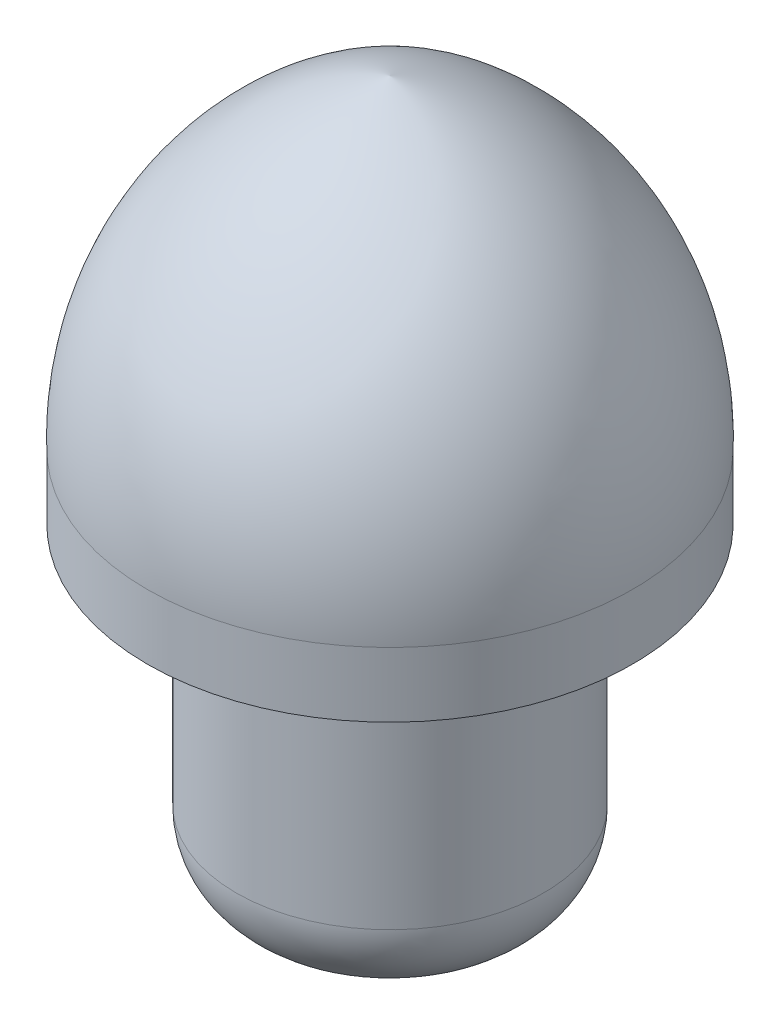
ISO-10303-21;
HEADER;
FILE_DESCRIPTION(('STEP AP214'),'2;1');
FILE_NAME('part.step','',(''),(''),'','','');
FILE_SCHEMA(('AUTOMOTIVE_DESIGN { 1 0 10303 214 1 1 1 1 }'));
ENDSEC;
DATA;
#1=APPLICATION_CONTEXT('core data for automotive mechanical design processes');
#2=APPLICATION_PROTOCOL_DEFINITION('international standard','automotive_design',2000,#1);
#3=PRODUCT_CONTEXT('',#1,'mechanical');
#4=PRODUCT('Part','Part','',(#3));
#5=PRODUCT_RELATED_PRODUCT_CATEGORY('part','',(#4));
#6=PRODUCT_DEFINITION_FORMATION('','',#4);
#7=PRODUCT_DEFINITION_CONTEXT('part definition',#1,'design');
#8=PRODUCT_DEFINITION('design','',#6,#7);
#9=PRODUCT_DEFINITION_SHAPE('','',#8);
#10=(LENGTH_UNIT() NAMED_UNIT(*) SI_UNIT(.MILLI.,.METRE.));
#11=(NAMED_UNIT(*) PLANE_ANGLE_UNIT() SI_UNIT($,.RADIAN.));
#12=(NAMED_UNIT(*) SI_UNIT($,.STERADIAN.) SOLID_ANGLE_UNIT());
#13=UNCERTAINTY_MEASURE_WITH_UNIT(LENGTH_MEASURE(1.E-05),#10,'distance_accuracy_value','');
#14=(GEOMETRIC_REPRESENTATION_CONTEXT(3) GLOBAL_UNCERTAINTY_ASSIGNED_CONTEXT((#13)) GLOBAL_UNIT_ASSIGNED_CONTEXT((#10,
#11,#12)) REPRESENTATION_CONTEXT('',''));
#15=CARTESIAN_POINT('',(0.,0.,0.));
#16=DIRECTION('',(0.,0.,1.));
#17=DIRECTION('',(1.,0.,0.));
#18=AXIS2_PLACEMENT_3D('',#15,#16,#17);
#19=CARTESIAN_POINT('',(0.,1.,0.));
#20=DIRECTION('',(0.,-1.,0.));
#21=DIRECTION('',(0.,0.,-1.));
#22=AXIS2_PLACEMENT_3D('',#19,#20,#21);
#23=CYLINDRICAL_SURFACE('',#22,15.);
#24=CARTESIAN_POINT('',(0.,-4.,0.));
#25=DIRECTION('',(0.,1.,0.));
#26=DIRECTION('',(0.,0.,1.));
#27=AXIS2_PLACEMENT_3D('',#24,#25,#26);
#28=CIRCLE('',#27,15.);
#29=CARTESIAN_POINT('',(0.,-4.,15.));
#30=VERTEX_POINT('',#29);
#31=EDGE_CURVE('E109',#30,#30,#28,.T.);
#32=ORIENTED_EDGE('',*,*,#31,.T.);
#33=EDGE_LOOP('',(#32));
#34=FACE_BOUND('',#33,.T.);
#35=CARTESIAN_POINT('',(0.,0.,0.));
#36=DIRECTION('',(0.,-1.,0.));
#37=DIRECTION('',(0.,0.,-1.));
#38=AXIS2_PLACEMENT_3D('',#35,#36,#37);
#39=CIRCLE('',#38,15.);
#40=CARTESIAN_POINT('',(0.,0.,-15.));
#41=VERTEX_POINT('',#40);
#42=EDGE_CURVE('E105',#41,#41,#39,.T.);
#43=ORIENTED_EDGE('',*,*,#42,.T.);
#44=EDGE_LOOP('',(#43));
#45=FACE_BOUND('',#44,.T.);
#46=ADVANCED_FACE('F42',(#34,#45),#23,.T.);
#47=CARTESIAN_POINT('',(0.,-4.,0.));
#48=DIRECTION('',(0.,1.,0.));
#49=DIRECTION('',(0.,0.,1.));
#50=AXIS2_PLACEMENT_3D('',#47,#48,#49);
#51=PLANE('',#50);
#52=CARTESIAN_POINT('',(0.,-4.,0.));
#53=DIRECTION('',(0.,-1.,0.));
#54=DIRECTION('',(0.,0.,-1.));
#55=AXIS2_PLACEMENT_3D('',#52,#53,#54);
#56=CIRCLE('',#55,9.5);
#57=CARTESIAN_POINT('',(0.,-4.,-9.5));
#58=VERTEX_POINT('',#57);
#59=EDGE_CURVE('E96',#58,#58,#56,.T.);
#60=ORIENTED_EDGE('',*,*,#59,.F.);
#61=EDGE_LOOP('',(#60));
#62=FACE_BOUND('',#61,.T.);
#63=ORIENTED_EDGE('',*,*,#31,.F.);
#64=EDGE_LOOP('',(#63));
#65=FACE_BOUND('',#64,.T.);
#66=ADVANCED_FACE('F75',(#62,#65),#51,.F.);
#67=CARTESIAN_POINT('',(0.,0.632503002402401,4.98999599679681));
#68=DIRECTION('',(-1.,0.,0.));
#69=DIRECTION('',(0.,0.,-1.));
#70=AXIS2_PLACEMENT_3D('',#67,#68,#69);
#71=CIRCLE('',#70,20.);
#72=TRIMMED_CURVE('',#71,(PARAMETER_VALUE(-1.31863264173032)),
(PARAMETER_VALUE(1.31863264173032)),.T.,.PARAMETER.);
#73=CARTESIAN_POINT('',(0.,0.632503002402401,0.));
#74=DIRECTION('',(0.,-1.,0.));
#75=AXIS1_PLACEMENT('',#73,#74);
#76=SURFACE_OF_REVOLUTION('',#72,#75);
#77=ORIENTED_EDGE('',*,*,#42,.F.);
#78=EDGE_LOOP('',(#77));
#79=FACE_BOUND('',#78,.T.);
#80=CARTESIAN_POINT('',(0.,20.,0.));
#81=VERTEX_POINT('',#80);
#82=VERTEX_LOOP('',#81);
#83=FACE_BOUND('',#82,.T.);
#84=ADVANCED_FACE('F71',(#79,#83),#76,.T.);
#85=CARTESIAN_POINT('',(0.,-24.,0.));
#86=DIRECTION('',(0.,1.,0.));
#87=DIRECTION('',(0.,0.,1.));
#88=AXIS2_PLACEMENT_3D('',#85,#86,#87);
#89=CYLINDRICAL_SURFACE('',#88,9.5);
#90=CARTESIAN_POINT('',(0.,-19.,0.));
#91=DIRECTION('',(0.,-1.,0.));
#92=DIRECTION('',(0.,0.,-1.));
#93=AXIS2_PLACEMENT_3D('',#90,#91,#92);
#94=CIRCLE('',#93,9.5);
#95=CARTESIAN_POINT('',(0.,-19.,-9.5));
#96=VERTEX_POINT('',#95);
#97=EDGE_CURVE('E11',#96,#96,#94,.F.);
#98=ORIENTED_EDGE('',*,*,#97,.T.);
#99=EDGE_LOOP('',(#98));
#100=FACE_BOUND('',#99,.T.);
#101=ORIENTED_EDGE('',*,*,#59,.T.);
#102=EDGE_LOOP('',(#101));
#103=FACE_BOUND('',#102,.T.);
#104=ADVANCED_FACE('F74',(#100,#103),#89,.T.);
#105=CARTESIAN_POINT('',(0.,-24.,0.));
#106=DIRECTION('',(0.,-1.,0.));
#107=DIRECTION('',(0.,0.,-1.));
#108=AXIS2_PLACEMENT_3D('',#105,#106,#107);
#109=PLANE('',#108);
#110=CARTESIAN_POINT('',(0.,-24.,0.));
#111=DIRECTION('',(0.,-1.,0.));
#112=DIRECTION('',(0.,0.,-1.));
#113=AXIS2_PLACEMENT_3D('',#110,#111,#112);
#114=CIRCLE('',#113,4.5);
#115=CARTESIAN_POINT('',(0.,-24.,-4.5));
#116=VERTEX_POINT('',#115);
#117=EDGE_CURVE('E52',#116,#116,#114,.T.);
#118=ORIENTED_EDGE('',*,*,#117,.T.);
#119=EDGE_LOOP('',(#118));
#120=FACE_BOUND('',#119,.T.);
#121=ADVANCED_FACE('F85',(#120),#109,.T.);
#122=CARTESIAN_POINT('',(0.,-19.,0.));
#123=DIRECTION('',(0.,-1.,0.));
#124=DIRECTION('',(0.,0.,-1.));
#125=AXIS2_PLACEMENT_3D('',#122,#123,#124);
#126=DEGENERATE_TOROIDAL_SURFACE('',#125,4.5,5.,.T.);
#127=ORIENTED_EDGE('',*,*,#97,.F.);
#128=EDGE_LOOP('',(#127));
#129=FACE_BOUND('',#128,.T.);
#130=ORIENTED_EDGE('',*,*,#117,.F.);
#131=EDGE_LOOP('',(#130));
#132=FACE_BOUND('',#131,.T.);
#133=ADVANCED_FACE('F44',(#129,#132),#126,.T.);
#134=CLOSED_SHELL('',(#46,#66,#84,#104,#121,#133));
#135=CARTESIAN_POINT('',(0.,0.46320967463423,5.26421544156784));
#136=DIRECTION('',(-1.,0.,0.));
#137=DIRECTION('',(0.,0.,-1.));
#138=AXIS2_PLACEMENT_3D('',#135,#136,#137);
#139=CIRCLE('',#138,19.2697835945766);
#140=TRIMMED_CURVE('',#139,(PARAMETER_VALUE(-1.29409392217045)),
(PARAMETER_VALUE(1.29409392217045)),.T.,.PARAMETER.);
#141=CARTESIAN_POINT('',(0.,0.46320967463423,0.));
#142=DIRECTION('',(0.,-1.,0.));
#143=AXIS1_PLACEMENT('',#141,#142);
#144=SURFACE_OF_REVOLUTION('',#140,#143);
#145=CARTESIAN_POINT('',(0.,1.,0.));
#146=DIRECTION('',(0.,1.,0.));
#147=DIRECTION('',(0.,0.,1.));
#148=AXIS2_PLACEMENT_3D('',#145,#146,#147);
#149=CIRCLE('',#148,13.998090129895);
#150=CARTESIAN_POINT('',(0.,1.,13.998090129895));
#151=VERTEX_POINT('',#150);
#152=EDGE_CURVE('E99',#151,#151,#149,.T.);
#153=ORIENTED_EDGE('',*,*,#152,.F.);
#154=EDGE_LOOP('',(#153));
#155=FACE_BOUND('',#154,.T.);
#156=CARTESIAN_POINT('',(0.,19.,0.));
#157=VERTEX_POINT('',#156);
#158=VERTEX_LOOP('',#157);
#159=FACE_BOUND('',#158,.T.);
#160=ADVANCED_FACE('F58',(#155,#159),#144,.F.);
#161=CARTESIAN_POINT('',(0.,1.,0.));
#162=DIRECTION('',(0.,1.,0.));
#163=DIRECTION('',(0.,0.,1.));
#164=AXIS2_PLACEMENT_3D('',#161,#162,#163);
#165=PLANE('',#164);
#166=ORIENTED_EDGE('',*,*,#152,.T.);
#167=EDGE_LOOP('',(#166));
#168=FACE_BOUND('',#167,.T.);
#169=ADVANCED_FACE('F60',(#168),#165,.T.);
#170=CLOSED_SHELL('',(#160,#169));
#171=ORIENTED_CLOSED_SHELL('',*,#170,.T.);
#172=BREP_WITH_VOIDS('B2',#134,(#171));
#173=ADVANCED_BREP_SHAPE_REPRESENTATION('',(#18,#172),#14);
#174=SHAPE_DEFINITION_REPRESENTATION(#9,#173);
ENDSEC;
END-ISO-10303-21;
